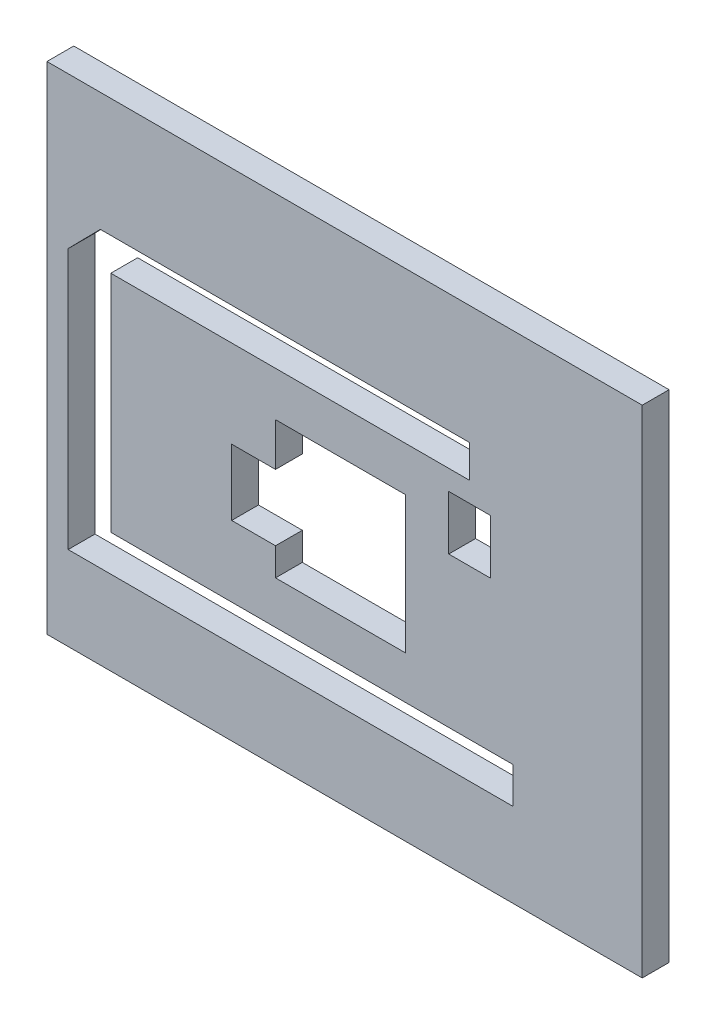
ISO-10303-21;
HEADER;
FILE_DESCRIPTION(('STEP AP214'),'2;1');
FILE_NAME('part.step','',(''),(''),'','','');
FILE_SCHEMA(('AUTOMOTIVE_DESIGN { 1 0 10303 214 1 1 1 1 }'));
ENDSEC;
DATA;
#1=APPLICATION_CONTEXT('core data for automotive mechanical design processes');
#2=APPLICATION_PROTOCOL_DEFINITION('international standard','automotive_design',2000,#1);
#3=PRODUCT_CONTEXT('',#1,'mechanical');
#4=PRODUCT('Part','Part','',(#3));
#5=PRODUCT_RELATED_PRODUCT_CATEGORY('part','',(#4));
#6=PRODUCT_DEFINITION_FORMATION('','',#4);
#7=PRODUCT_DEFINITION_CONTEXT('part definition',#1,'design');
#8=PRODUCT_DEFINITION('design','',#6,#7);
#9=PRODUCT_DEFINITION_SHAPE('','',#8);
#10=(LENGTH_UNIT() NAMED_UNIT(*) SI_UNIT(.MILLI.,.METRE.));
#11=(NAMED_UNIT(*) PLANE_ANGLE_UNIT() SI_UNIT($,.RADIAN.));
#12=(NAMED_UNIT(*) SI_UNIT($,.STERADIAN.) SOLID_ANGLE_UNIT());
#13=UNCERTAINTY_MEASURE_WITH_UNIT(LENGTH_MEASURE(1.E-05),#10,'distance_accuracy_value','');
#14=(GEOMETRIC_REPRESENTATION_CONTEXT(3) GLOBAL_UNCERTAINTY_ASSIGNED_CONTEXT((#13)) GLOBAL_UNIT_ASSIGNED_CONTEXT((#10,
#11,#12)) REPRESENTATION_CONTEXT('',''));
#15=CARTESIAN_POINT('',(0.,0.,0.));
#16=DIRECTION('',(0.,0.,1.));
#17=DIRECTION('',(1.,0.,0.));
#18=AXIS2_PLACEMENT_3D('',#15,#16,#17);
#19=CARTESIAN_POINT('',(0.,0.,5.));
#20=DIRECTION('',(0.,0.,1.));
#21=DIRECTION('',(1.,0.,0.));
#22=AXIS2_PLACEMENT_3D('',#19,#20,#21);
#23=PLANE('',#22);
#24=DIRECTION('',(0.,1.,0.));
#25=VECTOR('',#24,1.);
#26=CARTESIAN_POINT('',(105.705582562333,-4.66428571428569,5.));
#27=LINE('',#26,#25);
#28=CARTESIAN_POINT('',(105.705582562333,-4.66428571428569,5.));
#29=VERTEX_POINT('',#28);
#30=CARTESIAN_POINT('',(105.705582562333,87.8357142857143,5.));
#31=VERTEX_POINT('',#30);
#32=EDGE_CURVE('E465',#29,#31,#27,.T.);
#33=ORIENTED_EDGE('',*,*,#32,.T.);
#34=DIRECTION('',(1.,0.,0.));
#35=VECTOR('',#34,1.);
#36=CARTESIAN_POINT('',(-5.29441743766659,87.8357142857143,5.));
#37=LINE('',#36,#35);
#38=CARTESIAN_POINT('',(-5.29441743766659,87.8357142857143,5.));
#39=VERTEX_POINT('',#38);
#40=EDGE_CURVE('E239',#39,#31,#37,.T.);
#41=ORIENTED_EDGE('',*,*,#40,.F.);
#42=DIRECTION('',(0.,-1.,0.));
#43=VECTOR('',#42,1.);
#44=CARTESIAN_POINT('',(-5.29441743766659,81.8357142857143,5.));
#45=LINE('',#44,#43);
#46=CARTESIAN_POINT('',(-5.29441743766659,-4.66428571428569,5.));
#47=VERTEX_POINT('',#46);
#48=EDGE_CURVE('E222',#39,#47,#45,.T.);
#49=ORIENTED_EDGE('',*,*,#48,.T.);
#50=DIRECTION('',(1.,0.,0.));
#51=VECTOR('',#50,1.);
#52=CARTESIAN_POINT('',(-5.29441743766659,-4.66428571428569,5.));
#53=LINE('',#52,#51);
#54=EDGE_CURVE('E462',#47,#29,#53,.T.);
#55=ORIENTED_EDGE('',*,*,#54,.T.);
#56=EDGE_LOOP('',(#33,#41,#49,#55));
#57=FACE_BOUND('',#56,.T.);
#58=DIRECTION('',(1.,0.,0.));
#59=VECTOR('',#58,1.);
#60=CARTESIAN_POINT('',(-1.33990685098265,11.,5.));
#61=LINE('',#60,#59);
#62=CARTESIAN_POINT('',(-1.33990685098265,11.,5.));
#63=VERTEX_POINT('',#62);
#64=CARTESIAN_POINT('',(81.5868219148206,11.,5.));
#65=VERTEX_POINT('',#64);
#66=EDGE_CURVE('E371',#63,#65,#61,.T.);
#67=ORIENTED_EDGE('',*,*,#66,.F.);
#68=DIRECTION('',(0.,-1.,0.));
#69=VECTOR('',#68,1.);
#70=CARTESIAN_POINT('',(-1.33990685098265,59.6009474764159,5.));
#71=LINE('',#70,#69);
#72=CARTESIAN_POINT('',(-1.33990685098265,59.6009474764159,5.));
#73=VERTEX_POINT('',#72);
#74=EDGE_CURVE('E368',#73,#63,#71,.T.);
#75=ORIENTED_EDGE('',*,*,#74,.F.);
#76=DIRECTION('',(-0.700708014886171,-0.713448160607539,0.));
#77=VECTOR('',#76,1.);
#78=CARTESIAN_POINT('',(-1.33990685098265,59.6009474764159,5.));
#79=LINE('',#78,#77);
#80=CARTESIAN_POINT('',(4.65348353287961,65.7033085944974,5.));
#81=VERTEX_POINT('',#80);
#82=EDGE_CURVE('E394',#81,#73,#79,.T.);
#83=ORIENTED_EDGE('',*,*,#82,.F.);
#84=DIRECTION('',(-1.,0.,0.));
#85=VECTOR('',#84,1.);
#86=CARTESIAN_POINT('',(4.6534835328796,65.7033085944974,5.));
#87=LINE('',#86,#85);
#88=CARTESIAN_POINT('',(73.5229875801696,65.7033085944974,5.));
#89=VERTEX_POINT('',#88);
#90=EDGE_CURVE('E390',#89,#81,#87,.T.);
#91=ORIENTED_EDGE('',*,*,#90,.F.);
#92=DIRECTION('',(0.,1.,0.));
#93=VECTOR('',#92,1.);
#94=CARTESIAN_POINT('',(73.5229875801696,65.7033085944974,5.));
#95=LINE('',#94,#93);
#96=CARTESIAN_POINT('',(73.5229875801696,59.6009474764159,5.));
#97=VERTEX_POINT('',#96);
#98=EDGE_CURVE('E387',#97,#89,#95,.T.);
#99=ORIENTED_EDGE('',*,*,#98,.F.);
#100=DIRECTION('',(1.,0.,0.));
#101=VECTOR('',#100,1.);
#102=CARTESIAN_POINT('',(6.61495674941632,59.6009474764159,5.));
#103=LINE('',#102,#101);
#104=CARTESIAN_POINT('',(6.61495674941632,59.6009474764159,5.));
#105=VERTEX_POINT('',#104);
#106=EDGE_CURVE('E384',#105,#97,#103,.T.);
#107=ORIENTED_EDGE('',*,*,#106,.F.);
#108=DIRECTION('',(0.,1.,0.));
#109=VECTOR('',#108,1.);
#110=CARTESIAN_POINT('',(6.61495674941632,59.6009474764159,5.));
#111=LINE('',#110,#109);
#112=CARTESIAN_POINT('',(6.61495674941633,17.7561855236135,5.));
#113=VERTEX_POINT('',#112);
#114=EDGE_CURVE('E381',#113,#105,#111,.T.);
#115=ORIENTED_EDGE('',*,*,#114,.F.);
#116=DIRECTION('',(-1.,0.,0.));
#117=VECTOR('',#116,1.);
#118=CARTESIAN_POINT('',(6.61495674941633,17.7561855236135,5.));
#119=LINE('',#118,#117);
#120=CARTESIAN_POINT('',(81.5868219148206,17.7561855236136,5.));
#121=VERTEX_POINT('',#120);
#122=EDGE_CURVE('E378',#121,#113,#119,.T.);
#123=ORIENTED_EDGE('',*,*,#122,.F.);
#124=DIRECTION('',(0.,1.,0.));
#125=VECTOR('',#124,1.);
#126=CARTESIAN_POINT('',(81.5868219148206,17.7561855236136,5.));
#127=LINE('',#126,#125);
#128=EDGE_CURVE('E375',#65,#121,#127,.T.);
#129=ORIENTED_EDGE('',*,*,#128,.F.);
#130=EDGE_LOOP('',(#67,#75,#83,#91,#99,#107,#115,#123,#129));
#131=FACE_BOUND('',#130,.T.);
#132=DIRECTION('',(1.,0.,0.));
#133=VECTOR('',#132,1.);
#134=CARTESIAN_POINT('',(29.1519466340302,30.9450196952471,5.));
#135=LINE('',#134,#133);
#136=CARTESIAN_POINT('',(29.1519466340302,30.9450196952471,5.));
#137=VERTEX_POINT('',#136);
#138=CARTESIAN_POINT('',(37.3243604544091,30.9450196952471,5.));
#139=VERTEX_POINT('',#138);
#140=EDGE_CURVE('E288',#137,#139,#135,.T.);
#141=ORIENTED_EDGE('',*,*,#140,.F.);
#142=DIRECTION('',(0.,-1.,0.));
#143=VECTOR('',#142,1.);
#144=CARTESIAN_POINT('',(29.1519466340302,43.268500852969,5.));
#145=LINE('',#144,#143);
#146=CARTESIAN_POINT('',(29.1519466340302,43.268500852969,5.));
#147=VERTEX_POINT('',#146);
#148=EDGE_CURVE('E285',#147,#137,#145,.T.);
#149=ORIENTED_EDGE('',*,*,#148,.F.);
#150=DIRECTION('',(-1.,0.,0.));
#151=VECTOR('',#150,1.);
#152=CARTESIAN_POINT('',(29.1519466340302,43.268500852969,5.));
#153=LINE('',#152,#151);
#154=CARTESIAN_POINT('',(37.3243604544091,43.268500852969,5.));
#155=VERTEX_POINT('',#154);
#156=EDGE_CURVE('E308',#155,#147,#153,.T.);
#157=ORIENTED_EDGE('',*,*,#156,.F.);
#158=DIRECTION('',(0.,-1.,0.));
#159=VECTOR('',#158,1.);
#160=CARTESIAN_POINT('',(37.3243604544091,51.3111938190549,5.));
#161=LINE('',#160,#159);
#162=CARTESIAN_POINT('',(37.3243604544091,51.3111938190549,5.));
#163=VERTEX_POINT('',#162);
#164=EDGE_CURVE('E304',#163,#155,#161,.T.);
#165=ORIENTED_EDGE('',*,*,#164,.F.);
#166=DIRECTION('',(-1.,0.,0.));
#167=VECTOR('',#166,1.);
#168=CARTESIAN_POINT('',(37.3243604544091,51.3111938190549,5.));
#169=LINE('',#168,#167);
#170=CARTESIAN_POINT('',(61.5821602069621,51.3111938190549,5.));
#171=VERTEX_POINT('',#170);
#172=EDGE_CURVE('E301',#171,#163,#169,.T.);
#173=ORIENTED_EDGE('',*,*,#172,.F.);
#174=DIRECTION('',(0.,1.,0.));
#175=VECTOR('',#174,1.);
#176=CARTESIAN_POINT('',(61.5821602069621,51.3111938190549,5.));
#177=LINE('',#176,#175);
#178=CARTESIAN_POINT('',(61.5821602069621,25.7561855236135,5.));
#179=VERTEX_POINT('',#178);
#180=EDGE_CURVE('E298',#179,#171,#177,.T.);
#181=ORIENTED_EDGE('',*,*,#180,.F.);
#182=DIRECTION('',(1.,0.,0.));
#183=VECTOR('',#182,1.);
#184=CARTESIAN_POINT('',(37.3243604544091,25.7561855236136,5.));
#185=LINE('',#184,#183);
#186=CARTESIAN_POINT('',(37.3243604544091,25.7561855236136,5.));
#187=VERTEX_POINT('',#186);
#188=EDGE_CURVE('E295',#187,#179,#185,.T.);
#189=ORIENTED_EDGE('',*,*,#188,.F.);
#190=DIRECTION('',(0.,-1.,0.));
#191=VECTOR('',#190,1.);
#192=CARTESIAN_POINT('',(37.3243604544091,30.9450196952471,5.));
#193=LINE('',#192,#191);
#194=EDGE_CURVE('E292',#139,#187,#193,.T.);
#195=ORIENTED_EDGE('',*,*,#194,.F.);
#196=EDGE_LOOP('',(#141,#149,#157,#165,#173,#181,#189,#195));
#197=FACE_BOUND('',#196,.T.);
#198=DIRECTION('',(1.,0.,0.));
#199=VECTOR('',#198,1.);
#200=CARTESIAN_POINT('',(69.6248531730492,45.7561855236135,5.));
#201=LINE('',#200,#199);
#202=CARTESIAN_POINT('',(69.6248531730492,45.7561855236135,5.));
#203=VERTEX_POINT('',#202);
#204=CARTESIAN_POINT('',(77.4081044305528,45.7561855236135,5.));
#205=VERTEX_POINT('',#204);
#206=EDGE_CURVE('E250',#203,#205,#201,.T.);
#207=ORIENTED_EDGE('',*,*,#206,.F.);
#208=DIRECTION('',(0.,-1.,0.));
#209=VECTOR('',#208,1.);
#210=CARTESIAN_POINT('',(69.6248531730492,55.8744121584154,5.));
#211=LINE('',#210,#209);
#212=CARTESIAN_POINT('',(69.6248531730492,55.8744121584154,5.));
#213=VERTEX_POINT('',#212);
#214=EDGE_CURVE('E247',#213,#203,#211,.T.);
#215=ORIENTED_EDGE('',*,*,#214,.F.);
#216=DIRECTION('',(-1.,0.,0.));
#217=VECTOR('',#216,1.);
#218=CARTESIAN_POINT('',(69.6248531730492,55.8744121584154,5.));
#219=LINE('',#218,#217);
#220=CARTESIAN_POINT('',(77.4081044305528,55.8744121584154,5.));
#221=VERTEX_POINT('',#220);
#222=EDGE_CURVE('E257',#221,#213,#219,.T.);
#223=ORIENTED_EDGE('',*,*,#222,.F.);
#224=DIRECTION('',(0.,1.,0.));
#225=VECTOR('',#224,1.);
#226=CARTESIAN_POINT('',(77.4081044305528,55.8744121584154,5.));
#227=LINE('',#226,#225);
#228=EDGE_CURVE('E254',#205,#221,#227,.T.);
#229=ORIENTED_EDGE('',*,*,#228,.F.);
#230=EDGE_LOOP('',(#207,#215,#223,#229));
#231=FACE_BOUND('',#230,.T.);
#232=ADVANCED_FACE('F41',(#57,#131,#197,#231),#23,.T.);
#233=CARTESIAN_POINT('',(0.,0.,0.));
#234=DIRECTION('',(0.,0.,1.));
#235=DIRECTION('',(1.,0.,0.));
#236=AXIS2_PLACEMENT_3D('',#233,#234,#235);
#237=PLANE('',#236);
#238=DIRECTION('',(0.,-1.,0.));
#239=VECTOR('',#238,1.);
#240=CARTESIAN_POINT('',(29.1519466340302,43.268500852969,0.));
#241=LINE('',#240,#239);
#242=CARTESIAN_POINT('',(29.1519466340302,43.268500852969,0.));
#243=VERTEX_POINT('',#242);
#244=CARTESIAN_POINT('',(29.1519466340302,30.9450196952471,0.));
#245=VERTEX_POINT('',#244);
#246=EDGE_CURVE('E284',#243,#245,#241,.T.);
#247=ORIENTED_EDGE('',*,*,#246,.T.);
#248=DIRECTION('',(1.,0.,0.));
#249=VECTOR('',#248,1.);
#250=CARTESIAN_POINT('',(29.1519466340302,30.9450196952471,0.));
#251=LINE('',#250,#249);
#252=CARTESIAN_POINT('',(37.3243604544091,30.9450196952471,0.));
#253=VERTEX_POINT('',#252);
#254=EDGE_CURVE('E315',#245,#253,#251,.T.);
#255=ORIENTED_EDGE('',*,*,#254,.T.);
#256=DIRECTION('',(0.,-1.,0.));
#257=VECTOR('',#256,1.);
#258=CARTESIAN_POINT('',(37.3243604544091,30.9450196952471,0.));
#259=LINE('',#258,#257);
#260=CARTESIAN_POINT('',(37.3243604544091,25.7561855236136,0.));
#261=VERTEX_POINT('',#260);
#262=EDGE_CURVE('E319',#253,#261,#259,.T.);
#263=ORIENTED_EDGE('',*,*,#262,.T.);
#264=DIRECTION('',(1.,0.,0.));
#265=VECTOR('',#264,1.);
#266=CARTESIAN_POINT('',(37.3243604544091,25.7561855236136,0.));
#267=LINE('',#266,#265);
#268=CARTESIAN_POINT('',(61.5821602069621,25.7561855236135,0.));
#269=VERTEX_POINT('',#268);
#270=EDGE_CURVE('E323',#261,#269,#267,.T.);
#271=ORIENTED_EDGE('',*,*,#270,.T.);
#272=DIRECTION('',(0.,1.,0.));
#273=VECTOR('',#272,1.);
#274=CARTESIAN_POINT('',(61.5821602069621,51.3111938190549,0.));
#275=LINE('',#274,#273);
#276=CARTESIAN_POINT('',(61.5821602069621,51.3111938190549,0.));
#277=VERTEX_POINT('',#276);
#278=EDGE_CURVE('E327',#269,#277,#275,.T.);
#279=ORIENTED_EDGE('',*,*,#278,.T.);
#280=DIRECTION('',(-1.,0.,0.));
#281=VECTOR('',#280,1.);
#282=CARTESIAN_POINT('',(37.3243604544091,51.3111938190549,0.));
#283=LINE('',#282,#281);
#284=CARTESIAN_POINT('',(37.3243604544091,51.3111938190549,0.));
#285=VERTEX_POINT('',#284);
#286=EDGE_CURVE('E331',#277,#285,#283,.T.);
#287=ORIENTED_EDGE('',*,*,#286,.T.);
#288=DIRECTION('',(0.,-1.,0.));
#289=VECTOR('',#288,1.);
#290=CARTESIAN_POINT('',(37.3243604544091,51.3111938190549,0.));
#291=LINE('',#290,#289);
#292=CARTESIAN_POINT('',(37.3243604544091,43.268500852969,0.));
#293=VERTEX_POINT('',#292);
#294=EDGE_CURVE('E335',#285,#293,#291,.T.);
#295=ORIENTED_EDGE('',*,*,#294,.T.);
#296=DIRECTION('',(-1.,0.,0.));
#297=VECTOR('',#296,1.);
#298=CARTESIAN_POINT('',(29.1519466340302,43.268500852969,0.));
#299=LINE('',#298,#297);
#300=EDGE_CURVE('E289',#293,#243,#299,.T.);
#301=ORIENTED_EDGE('',*,*,#300,.T.);
#302=EDGE_LOOP('',(#247,#255,#263,#271,#279,#287,#295,#301));
#303=FACE_BOUND('',#302,.T.);
#304=DIRECTION('',(0.,-1.,0.));
#305=VECTOR('',#304,1.);
#306=CARTESIAN_POINT('',(-5.29441743766659,81.8357142857143,0.));
#307=LINE('',#306,#305);
#308=CARTESIAN_POINT('',(-5.29441743766659,87.8357142857143,0.));
#309=VERTEX_POINT('',#308);
#310=CARTESIAN_POINT('',(-5.29441743766659,-4.66428571428569,0.));
#311=VERTEX_POINT('',#310);
#312=EDGE_CURVE('E229',#309,#311,#307,.T.);
#313=ORIENTED_EDGE('',*,*,#312,.F.);
#314=DIRECTION('',(-1.,0.,0.));
#315=VECTOR('',#314,1.);
#316=CARTESIAN_POINT('',(105.705582562333,87.8357142857143,0.));
#317=LINE('',#316,#315);
#318=CARTESIAN_POINT('',(105.705582562333,87.8357142857143,0.));
#319=VERTEX_POINT('',#318);
#320=EDGE_CURVE('E226',#319,#309,#317,.T.);
#321=ORIENTED_EDGE('',*,*,#320,.F.);
#322=DIRECTION('',(0.,1.,0.));
#323=VECTOR('',#322,1.);
#324=CARTESIAN_POINT('',(105.705582562333,-4.66428571428569,0.));
#325=LINE('',#324,#323);
#326=CARTESIAN_POINT('',(105.705582562333,-4.66428571428569,0.));
#327=VERTEX_POINT('',#326);
#328=EDGE_CURVE('E212',#327,#319,#325,.T.);
#329=ORIENTED_EDGE('',*,*,#328,.F.);
#330=DIRECTION('',(1.,0.,0.));
#331=VECTOR('',#330,1.);
#332=CARTESIAN_POINT('',(-5.29441743766659,-4.66428571428569,0.));
#333=LINE('',#332,#331);
#334=EDGE_CURVE('E223',#311,#327,#333,.T.);
#335=ORIENTED_EDGE('',*,*,#334,.F.);
#336=EDGE_LOOP('',(#313,#321,#329,#335));
#337=FACE_BOUND('',#336,.T.);
#338=DIRECTION('',(0.,-1.,0.));
#339=VECTOR('',#338,1.);
#340=CARTESIAN_POINT('',(-1.33990685098265,59.6009474764159,0.));
#341=LINE('',#340,#339);
#342=CARTESIAN_POINT('',(-1.33990685098264,59.6009474764159,0.));
#343=VERTEX_POINT('',#342);
#344=CARTESIAN_POINT('',(-1.33990685098265,11.,0.));
#345=VERTEX_POINT('',#344);
#346=EDGE_CURVE('E367',#343,#345,#341,.T.);
#347=ORIENTED_EDGE('',*,*,#346,.T.);
#348=DIRECTION('',(1.,0.,0.));
#349=VECTOR('',#348,1.);
#350=CARTESIAN_POINT('',(6.61495674941633,11.,0.));
#351=LINE('',#350,#349);
#352=CARTESIAN_POINT('',(81.5868219148206,11.,0.));
#353=VERTEX_POINT('',#352);
#354=EDGE_CURVE('E401',#345,#353,#351,.T.);
#355=ORIENTED_EDGE('',*,*,#354,.T.);
#356=DIRECTION('',(0.,1.,0.));
#357=VECTOR('',#356,1.);
#358=CARTESIAN_POINT('',(81.5868219148206,17.7561855236136,0.));
#359=LINE('',#358,#357);
#360=CARTESIAN_POINT('',(81.5868219148206,17.7561855236136,0.));
#361=VERTEX_POINT('',#360);
#362=EDGE_CURVE('E405',#353,#361,#359,.T.);
#363=ORIENTED_EDGE('',*,*,#362,.T.);
#364=DIRECTION('',(-1.,0.,0.));
#365=VECTOR('',#364,1.);
#366=CARTESIAN_POINT('',(6.61495674941633,17.7561855236135,0.));
#367=LINE('',#366,#365);
#368=CARTESIAN_POINT('',(6.61495674941633,17.7561855236135,0.));
#369=VERTEX_POINT('',#368);
#370=EDGE_CURVE('E409',#361,#369,#367,.T.);
#371=ORIENTED_EDGE('',*,*,#370,.T.);
#372=DIRECTION('',(0.,1.,0.));
#373=VECTOR('',#372,1.);
#374=CARTESIAN_POINT('',(6.61495674941632,59.6009474764159,0.));
#375=LINE('',#374,#373);
#376=CARTESIAN_POINT('',(6.61495674941632,59.6009474764159,0.));
#377=VERTEX_POINT('',#376);
#378=EDGE_CURVE('E413',#369,#377,#375,.T.);
#379=ORIENTED_EDGE('',*,*,#378,.T.);
#380=DIRECTION('',(1.,0.,0.));
#381=VECTOR('',#380,1.);
#382=CARTESIAN_POINT('',(6.61495674941632,59.6009474764159,0.));
#383=LINE('',#382,#381);
#384=CARTESIAN_POINT('',(73.5229875801696,59.6009474764159,0.));
#385=VERTEX_POINT('',#384);
#386=EDGE_CURVE('E417',#377,#385,#383,.T.);
#387=ORIENTED_EDGE('',*,*,#386,.T.);
#388=DIRECTION('',(0.,1.,0.));
#389=VECTOR('',#388,1.);
#390=CARTESIAN_POINT('',(73.5229875801696,65.7033085944974,0.));
#391=LINE('',#390,#389);
#392=CARTESIAN_POINT('',(73.5229875801696,65.7033085944974,0.));
#393=VERTEX_POINT('',#392);
#394=EDGE_CURVE('E421',#385,#393,#391,.T.);
#395=ORIENTED_EDGE('',*,*,#394,.T.);
#396=DIRECTION('',(-1.,0.,0.));
#397=VECTOR('',#396,1.);
#398=CARTESIAN_POINT('',(4.6534835328796,65.7033085944974,0.));
#399=LINE('',#398,#397);
#400=CARTESIAN_POINT('',(4.6534835328796,65.7033085944974,0.));
#401=VERTEX_POINT('',#400);
#402=EDGE_CURVE('E425',#393,#401,#399,.T.);
#403=ORIENTED_EDGE('',*,*,#402,.T.);
#404=DIRECTION('',(-0.700708014886171,-0.713448160607539,0.));
#405=VECTOR('',#404,1.);
#406=CARTESIAN_POINT('',(-1.33990685098265,59.6009474764159,0.));
#407=LINE('',#406,#405);
#408=EDGE_CURVE('E372',#401,#343,#407,.T.);
#409=ORIENTED_EDGE('',*,*,#408,.T.);
#410=EDGE_LOOP('',(#347,#355,#363,#371,#379,#387,#395,#403,#409));
#411=FACE_BOUND('',#410,.T.);
#412=DIRECTION('',(0.,-1.,0.));
#413=VECTOR('',#412,1.);
#414=CARTESIAN_POINT('',(69.6248531730492,55.8744121584154,0.));
#415=LINE('',#414,#413);
#416=CARTESIAN_POINT('',(69.6248531730492,55.8744121584154,0.));
#417=VERTEX_POINT('',#416);
#418=CARTESIAN_POINT('',(69.6248531730492,45.7561855236135,0.));
#419=VERTEX_POINT('',#418);
#420=EDGE_CURVE('E65',#417,#419,#415,.T.);
#421=ORIENTED_EDGE('',*,*,#420,.T.);
#422=DIRECTION('',(1.,0.,0.));
#423=VECTOR('',#422,1.);
#424=CARTESIAN_POINT('',(69.6248531730492,45.7561855236135,0.));
#425=LINE('',#424,#423);
#426=CARTESIAN_POINT('',(77.4081044305528,45.7561855236135,0.));
#427=VERTEX_POINT('',#426);
#428=EDGE_CURVE('E263',#419,#427,#425,.T.);
#429=ORIENTED_EDGE('',*,*,#428,.T.);
#430=DIRECTION('',(0.,1.,0.));
#431=VECTOR('',#430,1.);
#432=CARTESIAN_POINT('',(77.4081044305528,55.8744121584154,0.));
#433=LINE('',#432,#431);
#434=CARTESIAN_POINT('',(77.4081044305528,55.8744121584154,0.));
#435=VERTEX_POINT('',#434);
#436=EDGE_CURVE('E267',#427,#435,#433,.T.);
#437=ORIENTED_EDGE('',*,*,#436,.T.);
#438=DIRECTION('',(-1.,0.,0.));
#439=VECTOR('',#438,1.);
#440=CARTESIAN_POINT('',(69.6248531730492,55.8744121584154,0.));
#441=LINE('',#440,#439);
#442=EDGE_CURVE('E251',#435,#417,#441,.T.);
#443=ORIENTED_EDGE('',*,*,#442,.T.);
#444=EDGE_LOOP('',(#421,#429,#437,#443));
#445=FACE_BOUND('',#444,.T.);
#446=ADVANCED_FACE('F227',(#303,#337,#411,#445),#237,.F.);
#447=CARTESIAN_POINT('',(-5.29441743766659,81.8357142857143,5.));
#448=DIRECTION('',(1.,0.,0.));
#449=DIRECTION('',(0.,0.,-1.));
#450=AXIS2_PLACEMENT_3D('',#447,#448,#449);
#451=PLANE('',#450);
#452=ORIENTED_EDGE('',*,*,#312,.T.);
#453=DIRECTION('',(0.,0.,-1.));
#454=VECTOR('',#453,1.);
#455=CARTESIAN_POINT('',(-5.29441743766659,-4.66428571428569,5.));
#456=LINE('',#455,#454);
#457=EDGE_CURVE('E11',#47,#311,#456,.T.);
#458=ORIENTED_EDGE('',*,*,#457,.F.);
#459=ORIENTED_EDGE('',*,*,#48,.F.);
#460=DIRECTION('',(0.,0.,1.));
#461=VECTOR('',#460,1.);
#462=CARTESIAN_POINT('',(-5.29441743766659,87.8357142857143,0.));
#463=LINE('',#462,#461);
#464=EDGE_CURVE('E234',#309,#39,#463,.T.);
#465=ORIENTED_EDGE('',*,*,#464,.F.);
#466=EDGE_LOOP('',(#452,#458,#459,#465));
#467=FACE_BOUND('',#466,.T.);
#468=ADVANCED_FACE('F43',(#467),#451,.F.);
#469=CARTESIAN_POINT('',(-5.29441743766659,-4.66428571428569,5.));
#470=DIRECTION('',(0.,1.,0.));
#471=DIRECTION('',(0.,0.,1.));
#472=AXIS2_PLACEMENT_3D('',#469,#470,#471);
#473=PLANE('',#472);
#474=ORIENTED_EDGE('',*,*,#334,.T.);
#475=DIRECTION('',(0.,0.,-1.));
#476=VECTOR('',#475,1.);
#477=CARTESIAN_POINT('',(105.705582562333,-4.66428571428569,5.));
#478=LINE('',#477,#476);
#479=EDGE_CURVE('E50',#29,#327,#478,.T.);
#480=ORIENTED_EDGE('',*,*,#479,.F.);
#481=ORIENTED_EDGE('',*,*,#54,.F.);
#482=ORIENTED_EDGE('',*,*,#457,.T.);
#483=EDGE_LOOP('',(#474,#480,#481,#482));
#484=FACE_BOUND('',#483,.T.);
#485=ADVANCED_FACE('F473',(#484),#473,.F.);
#486=CARTESIAN_POINT('',(105.705582562333,-4.66428571428569,5.));
#487=DIRECTION('',(-1.,0.,0.));
#488=DIRECTION('',(0.,0.,1.));
#489=AXIS2_PLACEMENT_3D('',#486,#487,#488);
#490=PLANE('',#489);
#491=ORIENTED_EDGE('',*,*,#328,.T.);
#492=DIRECTION('',(0.,0.,-1.));
#493=VECTOR('',#492,1.);
#494=CARTESIAN_POINT('',(105.705582562333,87.8357142857143,5.));
#495=LINE('',#494,#493);
#496=EDGE_CURVE('E217',#31,#319,#495,.T.);
#497=ORIENTED_EDGE('',*,*,#496,.F.);
#498=ORIENTED_EDGE('',*,*,#32,.F.);
#499=ORIENTED_EDGE('',*,*,#479,.T.);
#500=EDGE_LOOP('',(#491,#497,#498,#499));
#501=FACE_BOUND('',#500,.T.);
#502=ADVANCED_FACE('F214',(#501),#490,.F.);
#503=CARTESIAN_POINT('',(-1.33990685098265,59.6009474764159,5.));
#504=DIRECTION('',(1.,0.,0.));
#505=DIRECTION('',(0.,0.,-1.));
#506=AXIS2_PLACEMENT_3D('',#503,#504,#505);
#507=PLANE('',#506);
#508=ORIENTED_EDGE('',*,*,#346,.F.);
#509=DIRECTION('',(0.,0.,-1.));
#510=VECTOR('',#509,1.);
#511=CARTESIAN_POINT('',(-1.33990685098265,59.6009474764159,5.));
#512=LINE('',#511,#510);
#513=EDGE_CURVE('E397',#73,#343,#512,.T.);
#514=ORIENTED_EDGE('',*,*,#513,.F.);
#515=ORIENTED_EDGE('',*,*,#74,.T.);
#516=DIRECTION('',(0.,0.,-1.));
#517=VECTOR('',#516,1.);
#518=CARTESIAN_POINT('',(-1.33990685098265,11.,5.));
#519=LINE('',#518,#517);
#520=EDGE_CURVE('E456',#63,#345,#519,.T.);
#521=ORIENTED_EDGE('',*,*,#520,.T.);
#522=EDGE_LOOP('',(#508,#514,#515,#521));
#523=FACE_BOUND('',#522,.T.);
#524=ADVANCED_FACE('F579',(#523),#507,.T.);
#525=CARTESIAN_POINT('',(6.61495674941633,11.,5.));
#526=DIRECTION('',(0.,1.,0.));
#527=DIRECTION('',(-1.,0.,0.));
#528=AXIS2_PLACEMENT_3D('',#525,#526,#527);
#529=PLANE('',#528);
#530=ORIENTED_EDGE('',*,*,#354,.F.);
#531=ORIENTED_EDGE('',*,*,#520,.F.);
#532=ORIENTED_EDGE('',*,*,#66,.T.);
#533=DIRECTION('',(0.,0.,-1.));
#534=VECTOR('',#533,1.);
#535=CARTESIAN_POINT('',(81.5868219148206,11.,5.));
#536=LINE('',#535,#534);
#537=EDGE_CURVE('E453',#65,#353,#536,.T.);
#538=ORIENTED_EDGE('',*,*,#537,.T.);
#539=EDGE_LOOP('',(#530,#531,#532,#538));
#540=FACE_BOUND('',#539,.T.);
#541=ADVANCED_FACE('F575',(#540),#529,.T.);
#542=CARTESIAN_POINT('',(81.5868219148206,17.7561855236136,5.));
#543=DIRECTION('',(-1.,0.,0.));
#544=DIRECTION('',(0.,0.,1.));
#545=AXIS2_PLACEMENT_3D('',#542,#543,#544);
#546=PLANE('',#545);
#547=ORIENTED_EDGE('',*,*,#362,.F.);
#548=ORIENTED_EDGE('',*,*,#537,.F.);
#549=ORIENTED_EDGE('',*,*,#128,.T.);
#550=DIRECTION('',(0.,0.,-1.));
#551=VECTOR('',#550,1.);
#552=CARTESIAN_POINT('',(81.5868219148206,17.7561855236136,5.));
#553=LINE('',#552,#551);
#554=EDGE_CURVE('E450',#121,#361,#553,.T.);
#555=ORIENTED_EDGE('',*,*,#554,.T.);
#556=EDGE_LOOP('',(#547,#548,#549,#555));
#557=FACE_BOUND('',#556,.T.);
#558=ADVANCED_FACE('F571',(#557),#546,.T.);
#559=CARTESIAN_POINT('',(6.61495674941633,17.7561855236135,5.));
#560=DIRECTION('',(0.,-1.,0.));
#561=DIRECTION('',(1.,0.,0.));
#562=AXIS2_PLACEMENT_3D('',#559,#560,#561);
#563=PLANE('',#562);
#564=ORIENTED_EDGE('',*,*,#370,.F.);
#565=ORIENTED_EDGE('',*,*,#554,.F.);
#566=ORIENTED_EDGE('',*,*,#122,.T.);
#567=DIRECTION('',(0.,0.,-1.));
#568=VECTOR('',#567,1.);
#569=CARTESIAN_POINT('',(6.61495674941633,17.7561855236135,5.));
#570=LINE('',#569,#568);
#571=EDGE_CURVE('E447',#113,#369,#570,.T.);
#572=ORIENTED_EDGE('',*,*,#571,.T.);
#573=EDGE_LOOP('',(#564,#565,#566,#572));
#574=FACE_BOUND('',#573,.T.);
#575=ADVANCED_FACE('F567',(#574),#563,.T.);
#576=CARTESIAN_POINT('',(6.61495674941632,59.6009474764159,5.));
#577=DIRECTION('',(-1.,0.,0.));
#578=DIRECTION('',(0.,-1.,0.));
#579=AXIS2_PLACEMENT_3D('',#576,#577,#578);
#580=PLANE('',#579);
#581=ORIENTED_EDGE('',*,*,#378,.F.);
#582=ORIENTED_EDGE('',*,*,#571,.F.);
#583=ORIENTED_EDGE('',*,*,#114,.T.);
#584=DIRECTION('',(0.,0.,-1.));
#585=VECTOR('',#584,1.);
#586=CARTESIAN_POINT('',(6.61495674941632,59.6009474764159,5.));
#587=LINE('',#586,#585);
#588=EDGE_CURVE('E444',#105,#377,#587,.T.);
#589=ORIENTED_EDGE('',*,*,#588,.T.);
#590=EDGE_LOOP('',(#581,#582,#583,#589));
#591=FACE_BOUND('',#590,.T.);
#592=ADVANCED_FACE('F563',(#591),#580,.T.);
#593=CARTESIAN_POINT('',(6.61495674941632,59.6009474764159,5.));
#594=DIRECTION('',(0.,1.,0.));
#595=DIRECTION('',(-1.,0.,0.));
#596=AXIS2_PLACEMENT_3D('',#593,#594,#595);
#597=PLANE('',#596);
#598=ORIENTED_EDGE('',*,*,#386,.F.);
#599=ORIENTED_EDGE('',*,*,#588,.F.);
#600=ORIENTED_EDGE('',*,*,#106,.T.);
#601=DIRECTION('',(0.,0.,-1.));
#602=VECTOR('',#601,1.);
#603=CARTESIAN_POINT('',(73.5229875801696,59.6009474764159,5.));
#604=LINE('',#603,#602);
#605=EDGE_CURVE('E441',#97,#385,#604,.T.);
#606=ORIENTED_EDGE('',*,*,#605,.T.);
#607=EDGE_LOOP('',(#598,#599,#600,#606));
#608=FACE_BOUND('',#607,.T.);
#609=ADVANCED_FACE('F559',(#608),#597,.T.);
#610=CARTESIAN_POINT('',(73.5229875801696,65.7033085944974,5.));
#611=DIRECTION('',(-1.,0.,0.));
#612=DIRECTION('',(0.,-1.,0.));
#613=AXIS2_PLACEMENT_3D('',#610,#611,#612);
#614=PLANE('',#613);
#615=ORIENTED_EDGE('',*,*,#394,.F.);
#616=ORIENTED_EDGE('',*,*,#605,.F.);
#617=ORIENTED_EDGE('',*,*,#98,.T.);
#618=DIRECTION('',(0.,0.,-1.));
#619=VECTOR('',#618,1.);
#620=CARTESIAN_POINT('',(73.5229875801696,65.7033085944974,5.));
#621=LINE('',#620,#619);
#622=EDGE_CURVE('E438',#89,#393,#621,.T.);
#623=ORIENTED_EDGE('',*,*,#622,.T.);
#624=EDGE_LOOP('',(#615,#616,#617,#623));
#625=FACE_BOUND('',#624,.T.);
#626=ADVANCED_FACE('F555',(#625),#614,.T.);
#627=CARTESIAN_POINT('',(4.6534835328796,65.7033085944974,5.));
#628=DIRECTION('',(0.,-1.,0.));
#629=DIRECTION('',(1.,0.,0.));
#630=AXIS2_PLACEMENT_3D('',#627,#628,#629);
#631=PLANE('',#630);
#632=ORIENTED_EDGE('',*,*,#402,.F.);
#633=ORIENTED_EDGE('',*,*,#622,.F.);
#634=ORIENTED_EDGE('',*,*,#90,.T.);
#635=DIRECTION('',(0.,0.,-1.));
#636=VECTOR('',#635,1.);
#637=CARTESIAN_POINT('',(4.6534835328796,65.7033085944974,5.));
#638=LINE('',#637,#636);
#639=EDGE_CURVE('E435',#81,#401,#638,.T.);
#640=ORIENTED_EDGE('',*,*,#639,.T.);
#641=EDGE_LOOP('',(#632,#633,#634,#640));
#642=FACE_BOUND('',#641,.T.);
#643=ADVANCED_FACE('F551',(#642),#631,.T.);
#644=CARTESIAN_POINT('',(-1.33990685098265,59.6009474764159,5.));
#645=DIRECTION('',(0.713448160607539,-0.700708014886171,0.));
#646=DIRECTION('',(0.700708014886171,0.713448160607539,0.));
#647=AXIS2_PLACEMENT_3D('',#644,#645,#646);
#648=PLANE('',#647);
#649=ORIENTED_EDGE('',*,*,#408,.F.);
#650=ORIENTED_EDGE('',*,*,#639,.F.);
#651=ORIENTED_EDGE('',*,*,#82,.T.);
#652=ORIENTED_EDGE('',*,*,#513,.T.);
#653=EDGE_LOOP('',(#649,#650,#651,#652));
#654=FACE_BOUND('',#653,.T.);
#655=ADVANCED_FACE('F547',(#654),#648,.T.);
#656=CARTESIAN_POINT('',(29.1519466340302,43.268500852969,5.));
#657=DIRECTION('',(1.,0.,0.));
#658=DIRECTION('',(0.,0.,-1.));
#659=AXIS2_PLACEMENT_3D('',#656,#657,#658);
#660=PLANE('',#659);
#661=ORIENTED_EDGE('',*,*,#246,.F.);
#662=DIRECTION('',(0.,0.,-1.));
#663=VECTOR('',#662,1.);
#664=CARTESIAN_POINT('',(29.1519466340302,43.268500852969,5.));
#665=LINE('',#664,#663);
#666=EDGE_CURVE('E311',#147,#243,#665,.T.);
#667=ORIENTED_EDGE('',*,*,#666,.F.);
#668=ORIENTED_EDGE('',*,*,#148,.T.);
#669=DIRECTION('',(0.,0.,-1.));
#670=VECTOR('',#669,1.);
#671=CARTESIAN_POINT('',(29.1519466340302,30.9450196952471,5.));
#672=LINE('',#671,#670);
#673=EDGE_CURVE('E363',#137,#245,#672,.T.);
#674=ORIENTED_EDGE('',*,*,#673,.T.);
#675=EDGE_LOOP('',(#661,#667,#668,#674));
#676=FACE_BOUND('',#675,.T.);
#677=ADVANCED_FACE('F543',(#676),#660,.T.);
#678=CARTESIAN_POINT('',(29.1519466340302,30.9450196952471,5.));
#679=DIRECTION('',(0.,1.,0.));
#680=DIRECTION('',(0.,0.,1.));
#681=AXIS2_PLACEMENT_3D('',#678,#679,#680);
#682=PLANE('',#681);
#683=ORIENTED_EDGE('',*,*,#254,.F.);
#684=ORIENTED_EDGE('',*,*,#673,.F.);
#685=ORIENTED_EDGE('',*,*,#140,.T.);
#686=DIRECTION('',(0.,0.,-1.));
#687=VECTOR('',#686,1.);
#688=CARTESIAN_POINT('',(37.3243604544091,30.9450196952471,5.));
#689=LINE('',#688,#687);
#690=EDGE_CURVE('E360',#139,#253,#689,.T.);
#691=ORIENTED_EDGE('',*,*,#690,.T.);
#692=EDGE_LOOP('',(#683,#684,#685,#691));
#693=FACE_BOUND('',#692,.T.);
#694=ADVANCED_FACE('F539',(#693),#682,.T.);
#695=CARTESIAN_POINT('',(37.3243604544091,30.9450196952471,5.));
#696=DIRECTION('',(1.,0.,0.));
#697=DIRECTION('',(0.,0.,-1.));
#698=AXIS2_PLACEMENT_3D('',#695,#696,#697);
#699=PLANE('',#698);
#700=ORIENTED_EDGE('',*,*,#262,.F.);
#701=ORIENTED_EDGE('',*,*,#690,.F.);
#702=ORIENTED_EDGE('',*,*,#194,.T.);
#703=DIRECTION('',(0.,0.,-1.));
#704=VECTOR('',#703,1.);
#705=CARTESIAN_POINT('',(37.3243604544091,25.7561855236136,5.));
#706=LINE('',#705,#704);
#707=EDGE_CURVE('E357',#187,#261,#706,.T.);
#708=ORIENTED_EDGE('',*,*,#707,.T.);
#709=EDGE_LOOP('',(#700,#701,#702,#708));
#710=FACE_BOUND('',#709,.T.);
#711=ADVANCED_FACE('F535',(#710),#699,.T.);
#712=CARTESIAN_POINT('',(37.3243604544091,25.7561855236136,5.));
#713=DIRECTION('',(0.,1.,0.));
#714=DIRECTION('',(-1.,0.,0.));
#715=AXIS2_PLACEMENT_3D('',#712,#713,#714);
#716=PLANE('',#715);
#717=ORIENTED_EDGE('',*,*,#270,.F.);
#718=ORIENTED_EDGE('',*,*,#707,.F.);
#719=ORIENTED_EDGE('',*,*,#188,.T.);
#720=DIRECTION('',(0.,0.,-1.));
#721=VECTOR('',#720,1.);
#722=CARTESIAN_POINT('',(61.5821602069621,25.7561855236135,5.));
#723=LINE('',#722,#721);
#724=EDGE_CURVE('E354',#179,#269,#723,.T.);
#725=ORIENTED_EDGE('',*,*,#724,.T.);
#726=EDGE_LOOP('',(#717,#718,#719,#725));
#727=FACE_BOUND('',#726,.T.);
#728=ADVANCED_FACE('F531',(#727),#716,.T.);
#729=CARTESIAN_POINT('',(61.5821602069621,51.3111938190549,5.));
#730=DIRECTION('',(-1.,0.,0.));
#731=DIRECTION('',(0.,0.,1.));
#732=AXIS2_PLACEMENT_3D('',#729,#730,#731);
#733=PLANE('',#732);
#734=ORIENTED_EDGE('',*,*,#278,.F.);
#735=ORIENTED_EDGE('',*,*,#724,.F.);
#736=ORIENTED_EDGE('',*,*,#180,.T.);
#737=DIRECTION('',(0.,0.,-1.));
#738=VECTOR('',#737,1.);
#739=CARTESIAN_POINT('',(61.5821602069621,51.3111938190549,5.));
#740=LINE('',#739,#738);
#741=EDGE_CURVE('E351',#171,#277,#740,.T.);
#742=ORIENTED_EDGE('',*,*,#741,.T.);
#743=EDGE_LOOP('',(#734,#735,#736,#742));
#744=FACE_BOUND('',#743,.T.);
#745=ADVANCED_FACE('F527',(#744),#733,.T.);
#746=CARTESIAN_POINT('',(37.3243604544091,51.3111938190549,5.));
#747=DIRECTION('',(0.,-1.,0.));
#748=DIRECTION('',(0.,0.,-1.));
#749=AXIS2_PLACEMENT_3D('',#746,#747,#748);
#750=PLANE('',#749);
#751=ORIENTED_EDGE('',*,*,#286,.F.);
#752=ORIENTED_EDGE('',*,*,#741,.F.);
#753=ORIENTED_EDGE('',*,*,#172,.T.);
#754=DIRECTION('',(0.,0.,-1.));
#755=VECTOR('',#754,1.);
#756=CARTESIAN_POINT('',(37.3243604544091,51.3111938190549,5.));
#757=LINE('',#756,#755);
#758=EDGE_CURVE('E348',#163,#285,#757,.T.);
#759=ORIENTED_EDGE('',*,*,#758,.T.);
#760=EDGE_LOOP('',(#751,#752,#753,#759));
#761=FACE_BOUND('',#760,.T.);
#762=ADVANCED_FACE('F523',(#761),#750,.T.);
#763=CARTESIAN_POINT('',(37.3243604544091,51.3111938190549,5.));
#764=DIRECTION('',(1.,0.,0.));
#765=DIRECTION('',(0.,0.,-1.));
#766=AXIS2_PLACEMENT_3D('',#763,#764,#765);
#767=PLANE('',#766);
#768=ORIENTED_EDGE('',*,*,#294,.F.);
#769=ORIENTED_EDGE('',*,*,#758,.F.);
#770=ORIENTED_EDGE('',*,*,#164,.T.);
#771=DIRECTION('',(0.,0.,-1.));
#772=VECTOR('',#771,1.);
#773=CARTESIAN_POINT('',(37.3243604544091,43.268500852969,5.));
#774=LINE('',#773,#772);
#775=EDGE_CURVE('E345',#155,#293,#774,.T.);
#776=ORIENTED_EDGE('',*,*,#775,.T.);
#777=EDGE_LOOP('',(#768,#769,#770,#776));
#778=FACE_BOUND('',#777,.T.);
#779=ADVANCED_FACE('F519',(#778),#767,.T.);
#780=CARTESIAN_POINT('',(29.1519466340302,43.268500852969,5.));
#781=DIRECTION('',(0.,-1.,0.));
#782=DIRECTION('',(0.,0.,-1.));
#783=AXIS2_PLACEMENT_3D('',#780,#781,#782);
#784=PLANE('',#783);
#785=ORIENTED_EDGE('',*,*,#300,.F.);
#786=ORIENTED_EDGE('',*,*,#775,.F.);
#787=ORIENTED_EDGE('',*,*,#156,.T.);
#788=ORIENTED_EDGE('',*,*,#666,.T.);
#789=EDGE_LOOP('',(#785,#786,#787,#788));
#790=FACE_BOUND('',#789,.T.);
#791=ADVANCED_FACE('F516',(#790),#784,.T.);
#792=CARTESIAN_POINT('',(69.6248531730492,55.8744121584154,5.));
#793=DIRECTION('',(1.,0.,0.));
#794=DIRECTION('',(0.,0.,-1.));
#795=AXIS2_PLACEMENT_3D('',#792,#793,#794);
#796=PLANE('',#795);
#797=ORIENTED_EDGE('',*,*,#420,.F.);
#798=DIRECTION('',(0.,0.,-1.));
#799=VECTOR('',#798,1.);
#800=CARTESIAN_POINT('',(69.6248531730492,55.8744121584154,5.));
#801=LINE('',#800,#799);
#802=EDGE_CURVE('E260',#213,#417,#801,.T.);
#803=ORIENTED_EDGE('',*,*,#802,.F.);
#804=ORIENTED_EDGE('',*,*,#214,.T.);
#805=DIRECTION('',(0.,0.,-1.));
#806=VECTOR('',#805,1.);
#807=CARTESIAN_POINT('',(69.6248531730492,45.7561855236135,5.));
#808=LINE('',#807,#806);
#809=EDGE_CURVE('E281',#203,#419,#808,.T.);
#810=ORIENTED_EDGE('',*,*,#809,.T.);
#811=EDGE_LOOP('',(#797,#803,#804,#810));
#812=FACE_BOUND('',#811,.T.);
#813=ADVANCED_FACE('F501',(#812),#796,.T.);
#814=CARTESIAN_POINT('',(69.6248531730492,45.7561855236135,5.));
#815=DIRECTION('',(0.,1.,0.));
#816=DIRECTION('',(-1.,0.,0.));
#817=AXIS2_PLACEMENT_3D('',#814,#815,#816);
#818=PLANE('',#817);
#819=ORIENTED_EDGE('',*,*,#428,.F.);
#820=ORIENTED_EDGE('',*,*,#809,.F.);
#821=ORIENTED_EDGE('',*,*,#206,.T.);
#822=DIRECTION('',(0.,0.,-1.));
#823=VECTOR('',#822,1.);
#824=CARTESIAN_POINT('',(77.4081044305528,45.7561855236135,5.));
#825=LINE('',#824,#823);
#826=EDGE_CURVE('E278',#205,#427,#825,.T.);
#827=ORIENTED_EDGE('',*,*,#826,.T.);
#828=EDGE_LOOP('',(#819,#820,#821,#827));
#829=FACE_BOUND('',#828,.T.);
#830=ADVANCED_FACE('F496',(#829),#818,.T.);
#831=CARTESIAN_POINT('',(77.4081044305528,55.8744121584154,5.));
#832=DIRECTION('',(-1.,0.,0.));
#833=DIRECTION('',(0.,0.,1.));
#834=AXIS2_PLACEMENT_3D('',#831,#832,#833);
#835=PLANE('',#834);
#836=ORIENTED_EDGE('',*,*,#436,.F.);
#837=ORIENTED_EDGE('',*,*,#826,.F.);
#838=ORIENTED_EDGE('',*,*,#228,.T.);
#839=DIRECTION('',(0.,0.,-1.));
#840=VECTOR('',#839,1.);
#841=CARTESIAN_POINT('',(77.4081044305528,55.8744121584154,5.));
#842=LINE('',#841,#840);
#843=EDGE_CURVE('E57',#221,#435,#842,.T.);
#844=ORIENTED_EDGE('',*,*,#843,.T.);
#845=EDGE_LOOP('',(#836,#837,#838,#844));
#846=FACE_BOUND('',#845,.T.);
#847=ADVANCED_FACE('F499',(#846),#835,.T.);
#848=CARTESIAN_POINT('',(69.6248531730492,55.8744121584154,5.));
#849=DIRECTION('',(0.,-1.,0.));
#850=DIRECTION('',(1.,0.,0.));
#851=AXIS2_PLACEMENT_3D('',#848,#849,#850);
#852=PLANE('',#851);
#853=ORIENTED_EDGE('',*,*,#442,.F.);
#854=ORIENTED_EDGE('',*,*,#843,.F.);
#855=ORIENTED_EDGE('',*,*,#222,.T.);
#856=ORIENTED_EDGE('',*,*,#802,.T.);
#857=EDGE_LOOP('',(#853,#854,#855,#856));
#858=FACE_BOUND('',#857,.T.);
#859=ADVANCED_FACE('F502',(#858),#852,.T.);
#860=CARTESIAN_POINT('',(0.,87.8357142857143,0.));
#861=DIRECTION('',(0.,1.,0.));
#862=DIRECTION('',(0.,0.,1.));
#863=AXIS2_PLACEMENT_3D('',#860,#861,#862);
#864=PLANE('',#863);
#865=ORIENTED_EDGE('',*,*,#496,.T.);
#866=ORIENTED_EDGE('',*,*,#320,.T.);
#867=ORIENTED_EDGE('',*,*,#464,.T.);
#868=ORIENTED_EDGE('',*,*,#40,.T.);
#869=EDGE_LOOP('',(#865,#866,#867,#868));
#870=FACE_BOUND('',#869,.T.);
#871=ADVANCED_FACE('F237',(#870),#864,.T.);
#872=CLOSED_SHELL('',(#232,#446,#468,#485,#502,#524,#541,#558,#575,#592,#609,#626,#643,#655,
#677,#694,#711,#728,#745,#762,#779,#791,#813,#830,#847,#859,#871));
#873=MANIFOLD_SOLID_BREP('B2',#872);
#874=ADVANCED_BREP_SHAPE_REPRESENTATION('',(#18,#873),#14);
#875=SHAPE_DEFINITION_REPRESENTATION(#9,#874);
ENDSEC;
END-ISO-10303-21;
